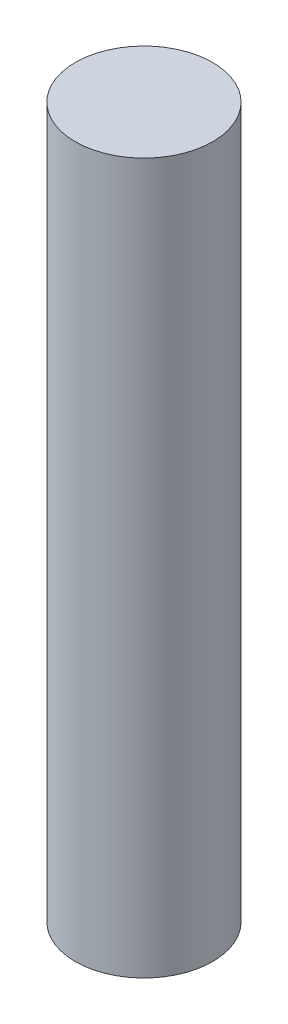
ISO-10303-21;
HEADER;
FILE_DESCRIPTION(('STEP AP214'),'2;1');
FILE_NAME('part.step','',(''),(''),'','','');
FILE_SCHEMA(('AUTOMOTIVE_DESIGN { 1 0 10303 214 1 1 1 1 }'));
ENDSEC;
DATA;
#1=APPLICATION_CONTEXT('core data for automotive mechanical design processes');
#2=APPLICATION_PROTOCOL_DEFINITION('international standard','automotive_design',2000,#1);
#3=PRODUCT_CONTEXT('',#1,'mechanical');
#4=PRODUCT('Part','Part','',(#3));
#5=PRODUCT_RELATED_PRODUCT_CATEGORY('part','',(#4));
#6=PRODUCT_DEFINITION_FORMATION('','',#4);
#7=PRODUCT_DEFINITION_CONTEXT('part definition',#1,'design');
#8=PRODUCT_DEFINITION('design','',#6,#7);
#9=PRODUCT_DEFINITION_SHAPE('','',#8);
#10=(LENGTH_UNIT() NAMED_UNIT(*) SI_UNIT(.MILLI.,.METRE.));
#11=(NAMED_UNIT(*) PLANE_ANGLE_UNIT() SI_UNIT($,.RADIAN.));
#12=(NAMED_UNIT(*) SI_UNIT($,.STERADIAN.) SOLID_ANGLE_UNIT());
#13=UNCERTAINTY_MEASURE_WITH_UNIT(LENGTH_MEASURE(1.E-05),#10,'distance_accuracy_value','');
#14=(GEOMETRIC_REPRESENTATION_CONTEXT(3) GLOBAL_UNCERTAINTY_ASSIGNED_CONTEXT((#13)) GLOBAL_UNIT_ASSIGNED_CONTEXT((#10,
#11,#12)) REPRESENTATION_CONTEXT('',''));
#15=CARTESIAN_POINT('',(0.,0.,0.));
#16=DIRECTION('',(0.,0.,1.));
#17=DIRECTION('',(1.,0.,0.));
#18=AXIS2_PLACEMENT_3D('',#15,#16,#17);
#19=CARTESIAN_POINT('',(0.,20.675,0.));
#20=DIRECTION('',(0.,-1.,0.));
#21=DIRECTION('',(0.,0.,-1.));
#22=AXIS2_PLACEMENT_3D('',#19,#20,#21);
#23=CYLINDRICAL_SURFACE('',#22,4.);
#24=CARTESIAN_POINT('',(0.,20.675,0.));
#25=DIRECTION('',(0.,1.,0.));
#26=DIRECTION('',(0.,0.,1.));
#27=AXIS2_PLACEMENT_3D('',#24,#25,#26);
#28=CIRCLE('',#27,4.);
#29=CARTESIAN_POINT('',(0.,20.675,4.));
#30=VERTEX_POINT('',#29);
#31=EDGE_CURVE('E10',#30,#30,#28,.T.);
#32=ORIENTED_EDGE('',*,*,#31,.F.);
#33=EDGE_LOOP('',(#32));
#34=FACE_BOUND('',#33,.T.);
#35=CARTESIAN_POINT('',(0.,-20.675,0.));
#36=DIRECTION('',(0.,1.,0.));
#37=DIRECTION('',(0.,0.,1.));
#38=AXIS2_PLACEMENT_3D('',#35,#36,#37);
#39=CIRCLE('',#38,4.);
#40=CARTESIAN_POINT('',(0.,-20.675,4.));
#41=VERTEX_POINT('',#40);
#42=EDGE_CURVE('E42',#41,#41,#39,.T.);
#43=ORIENTED_EDGE('',*,*,#42,.T.);
#44=EDGE_LOOP('',(#43));
#45=FACE_BOUND('',#44,.T.);
#46=ADVANCED_FACE('F39',(#34,#45),#23,.T.);
#47=CARTESIAN_POINT('',(0.,20.675,0.));
#48=DIRECTION('',(0.,1.,0.));
#49=DIRECTION('',(0.,0.,1.));
#50=AXIS2_PLACEMENT_3D('',#47,#48,#49);
#51=PLANE('',#50);
#52=ORIENTED_EDGE('',*,*,#31,.T.);
#53=EDGE_LOOP('',(#52));
#54=FACE_BOUND('',#53,.T.);
#55=ADVANCED_FACE('F54',(#54),#51,.T.);
#56=CARTESIAN_POINT('',(0.,-20.675,0.));
#57=DIRECTION('',(0.,1.,0.));
#58=DIRECTION('',(0.,0.,1.));
#59=AXIS2_PLACEMENT_3D('',#56,#57,#58);
#60=PLANE('',#59);
#61=ORIENTED_EDGE('',*,*,#42,.F.);
#62=EDGE_LOOP('',(#61));
#63=FACE_BOUND('',#62,.T.);
#64=ADVANCED_FACE('F52',(#63),#60,.F.);
#65=CLOSED_SHELL('',(#46,#55,#64));
#66=MANIFOLD_SOLID_BREP('B2',#65);
#67=ADVANCED_BREP_SHAPE_REPRESENTATION('',(#18,#66),#14);
#68=SHAPE_DEFINITION_REPRESENTATION(#9,#67);
ENDSEC;
END-ISO-10303-21;
